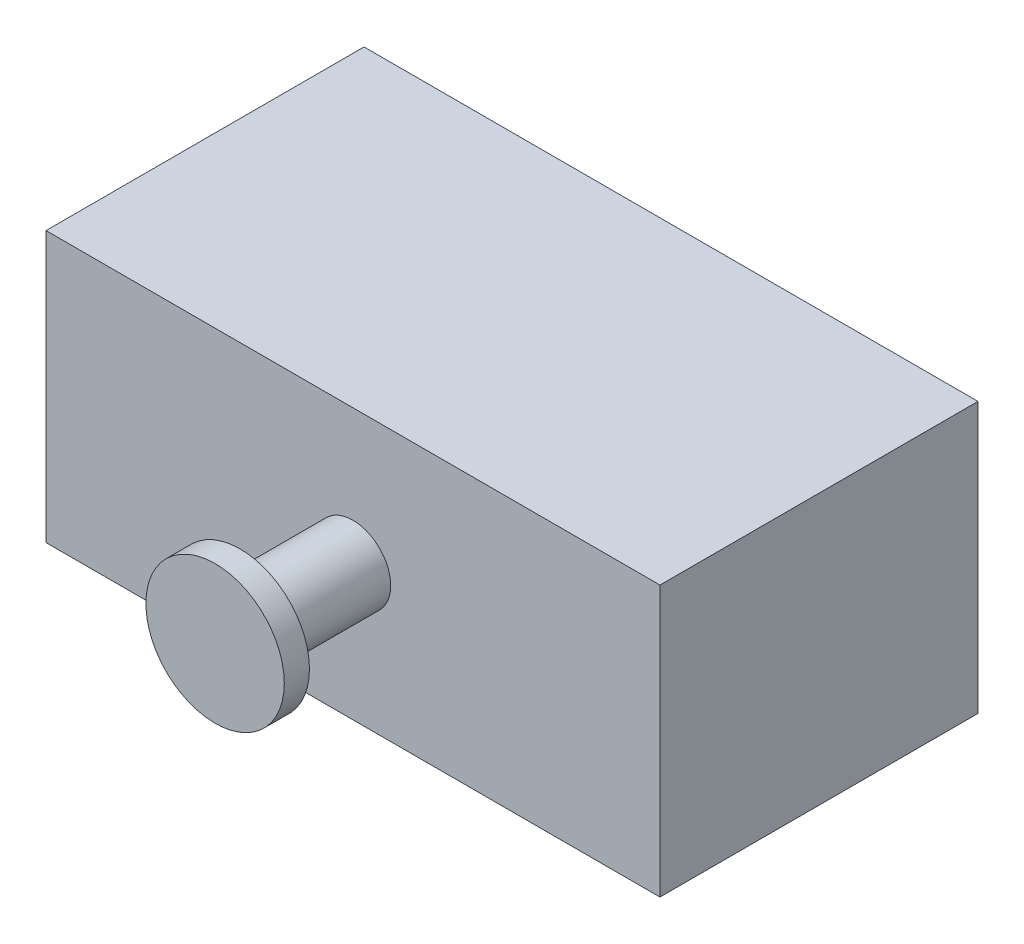
ISO-10303-21;
HEADER;
FILE_DESCRIPTION(('STEP AP214'),'2;1');
FILE_NAME('part.step','',(''),(''),'','','');
FILE_SCHEMA(('AUTOMOTIVE_DESIGN { 1 0 10303 214 1 1 1 1 }'));
ENDSEC;
DATA;
#1=APPLICATION_CONTEXT('core data for automotive mechanical design processes');
#2=APPLICATION_PROTOCOL_DEFINITION('international standard','automotive_design',2000,#1);
#3=PRODUCT_CONTEXT('',#1,'mechanical');
#4=PRODUCT('Part','Part','',(#3));
#5=PRODUCT_RELATED_PRODUCT_CATEGORY('part','',(#4));
#6=PRODUCT_DEFINITION_FORMATION('','',#4);
#7=PRODUCT_DEFINITION_CONTEXT('part definition',#1,'design');
#8=PRODUCT_DEFINITION('design','',#6,#7);
#9=PRODUCT_DEFINITION_SHAPE('','',#8);
#10=(LENGTH_UNIT() NAMED_UNIT(*) SI_UNIT(.MILLI.,.METRE.));
#11=(NAMED_UNIT(*) PLANE_ANGLE_UNIT() SI_UNIT($,.RADIAN.));
#12=(NAMED_UNIT(*) SI_UNIT($,.STERADIAN.) SOLID_ANGLE_UNIT());
#13=UNCERTAINTY_MEASURE_WITH_UNIT(LENGTH_MEASURE(1.E-05),#10,'distance_accuracy_value','');
#14=(GEOMETRIC_REPRESENTATION_CONTEXT(3) GLOBAL_UNCERTAINTY_ASSIGNED_CONTEXT((#13)) GLOBAL_UNIT_ASSIGNED_CONTEXT((#10,
#11,#12)) REPRESENTATION_CONTEXT('',''));
#15=CARTESIAN_POINT('',(0.,0.,0.));
#16=DIRECTION('',(0.,0.,1.));
#17=DIRECTION('',(1.,0.,0.));
#18=AXIS2_PLACEMENT_3D('',#15,#16,#17);
#19=CARTESIAN_POINT('',(-43.2996724615772,-115.618508944318,160.528));
#20=DIRECTION('',(0.,0.,1.));
#21=DIRECTION('',(1.,0.,0.));
#22=AXIS2_PLACEMENT_3D('',#19,#20,#21);
#23=PLANE('',#22);
#24=DIRECTION('',(0.,-1.,0.));
#25=VECTOR('',#24,1.);
#26=CARTESIAN_POINT('',(-43.2996724615772,20.7794910556815,160.528));
#27=LINE('',#26,#25);
#28=CARTESIAN_POINT('',(-43.2996724615772,20.7794910556815,160.528));
#29=VERTEX_POINT('',#28);
#30=CARTESIAN_POINT('',(-43.2996724615772,-115.618508944318,160.528));
#31=VERTEX_POINT('',#30);
#32=EDGE_CURVE('E84',#29,#31,#27,.T.);
#33=ORIENTED_EDGE('',*,*,#32,.T.);
#34=DIRECTION('',(1.,0.,0.));
#35=VECTOR('',#34,1.);
#36=CARTESIAN_POINT('',(-43.2996724615772,-115.618508944318,160.528));
#37=LINE('',#36,#35);
#38=CARTESIAN_POINT('',(266.580327538423,-115.618508944318,160.528));
#39=VERTEX_POINT('',#38);
#40=EDGE_CURVE('E79',#31,#39,#37,.T.);
#41=ORIENTED_EDGE('',*,*,#40,.T.);
#42=DIRECTION('',(0.,1.,0.));
#43=VECTOR('',#42,1.);
#44=CARTESIAN_POINT('',(266.580327538423,20.7794910556815,160.528));
#45=LINE('',#44,#43);
#46=CARTESIAN_POINT('',(266.580327538423,20.7794910556815,160.528));
#47=VERTEX_POINT('',#46);
#48=EDGE_CURVE('E82',#39,#47,#45,.T.);
#49=ORIENTED_EDGE('',*,*,#48,.T.);
#50=DIRECTION('',(-1.,0.,0.));
#51=VECTOR('',#50,1.);
#52=CARTESIAN_POINT('',(-43.2996724615772,20.7794910556815,160.528));
#53=LINE('',#52,#51);
#54=EDGE_CURVE('E49',#47,#29,#53,.T.);
#55=ORIENTED_EDGE('',*,*,#54,.T.);
#56=EDGE_LOOP('',(#33,#41,#49,#55));
#57=FACE_BOUND('',#56,.T.);
#58=CARTESIAN_POINT('',(111.640327538423,-47.4195089443185,160.528));
#59=DIRECTION('',(0.,0.,1.));
#60=DIRECTION('',(1.,0.,0.));
#61=AXIS2_PLACEMENT_3D('',#58,#59,#60);
#62=CIRCLE('',#61,19.05);
#63=CARTESIAN_POINT('',(130.690327538423,-47.4195089443185,160.528));
#64=VERTEX_POINT('',#63);
#65=EDGE_CURVE('E110',#64,#64,#62,.T.);
#66=ORIENTED_EDGE('',*,*,#65,.F.);
#67=EDGE_LOOP('',(#66));
#68=FACE_BOUND('',#67,.T.);
#69=ADVANCED_FACE('F32',(#57,#68),#23,.T.);
#70=CARTESIAN_POINT('',(-43.2996724615772,20.7794910556815,160.528));
#71=DIRECTION('',(1.,0.,0.));
#72=DIRECTION('',(0.,1.,0.));
#73=AXIS2_PLACEMENT_3D('',#70,#71,#72);
#74=PLANE('',#73);
#75=DIRECTION('',(0.,-1.,0.));
#76=VECTOR('',#75,1.);
#77=CARTESIAN_POINT('',(-43.2996724615772,20.7794910556815,0.));
#78=LINE('',#77,#76);
#79=CARTESIAN_POINT('',(-43.2996724615772,20.7794910556815,0.));
#80=VERTEX_POINT('',#79);
#81=CARTESIAN_POINT('',(-43.2996724615772,-115.618508944318,0.));
#82=VERTEX_POINT('',#81);
#83=EDGE_CURVE('E96',#80,#82,#78,.T.);
#84=ORIENTED_EDGE('',*,*,#83,.T.);
#85=DIRECTION('',(0.,0.,-1.));
#86=VECTOR('',#85,1.);
#87=CARTESIAN_POINT('',(-43.2996724615772,-115.618508944318,160.528));
#88=LINE('',#87,#86);
#89=EDGE_CURVE('E11',#31,#82,#88,.T.);
#90=ORIENTED_EDGE('',*,*,#89,.F.);
#91=ORIENTED_EDGE('',*,*,#32,.F.);
#92=DIRECTION('',(0.,0.,-1.));
#93=VECTOR('',#92,1.);
#94=CARTESIAN_POINT('',(-43.2996724615772,20.7794910556815,160.528));
#95=LINE('',#94,#93);
#96=EDGE_CURVE('E92',#29,#80,#95,.T.);
#97=ORIENTED_EDGE('',*,*,#96,.T.);
#98=EDGE_LOOP('',(#84,#90,#91,#97));
#99=FACE_BOUND('',#98,.T.);
#100=ADVANCED_FACE('F34',(#99),#74,.F.);
#101=CARTESIAN_POINT('',(-43.2996724615772,-115.618508944318,160.528));
#102=DIRECTION('',(0.,1.,0.));
#103=DIRECTION('',(0.,0.,1.));
#104=AXIS2_PLACEMENT_3D('',#101,#102,#103);
#105=PLANE('',#104);
#106=DIRECTION('',(1.,0.,0.));
#107=VECTOR('',#106,1.);
#108=CARTESIAN_POINT('',(-43.2996724615772,-115.618508944318,0.));
#109=LINE('',#108,#107);
#110=CARTESIAN_POINT('',(266.580327538423,-115.618508944318,0.));
#111=VERTEX_POINT('',#110);
#112=EDGE_CURVE('E88',#82,#111,#109,.T.);
#113=ORIENTED_EDGE('',*,*,#112,.T.);
#114=DIRECTION('',(0.,0.,-1.));
#115=VECTOR('',#114,1.);
#116=CARTESIAN_POINT('',(266.580327538423,-115.618508944318,160.528));
#117=LINE('',#116,#115);
#118=EDGE_CURVE('E41',#39,#111,#117,.T.);
#119=ORIENTED_EDGE('',*,*,#118,.F.);
#120=ORIENTED_EDGE('',*,*,#40,.F.);
#121=ORIENTED_EDGE('',*,*,#89,.T.);
#122=EDGE_LOOP('',(#113,#119,#120,#121));
#123=FACE_BOUND('',#122,.T.);
#124=ADVANCED_FACE('F87',(#123),#105,.F.);
#125=CARTESIAN_POINT('',(266.580327538423,20.7794910556815,160.528));
#126=DIRECTION('',(-1.,0.,0.));
#127=DIRECTION('',(0.,0.,1.));
#128=AXIS2_PLACEMENT_3D('',#125,#126,#127);
#129=PLANE('',#128);
#130=DIRECTION('',(0.,1.,0.));
#131=VECTOR('',#130,1.);
#132=CARTESIAN_POINT('',(266.580327538423,20.7794910556815,0.));
#133=LINE('',#132,#131);
#134=CARTESIAN_POINT('',(266.580327538423,20.7794910556815,0.));
#135=VERTEX_POINT('',#134);
#136=EDGE_CURVE('E66',#111,#135,#133,.T.);
#137=ORIENTED_EDGE('',*,*,#136,.T.);
#138=DIRECTION('',(0.,0.,-1.));
#139=VECTOR('',#138,1.);
#140=CARTESIAN_POINT('',(266.580327538423,20.7794910556815,160.528));
#141=LINE('',#140,#139);
#142=EDGE_CURVE('E89',#47,#135,#141,.T.);
#143=ORIENTED_EDGE('',*,*,#142,.F.);
#144=ORIENTED_EDGE('',*,*,#48,.F.);
#145=ORIENTED_EDGE('',*,*,#118,.T.);
#146=EDGE_LOOP('',(#137,#143,#144,#145));
#147=FACE_BOUND('',#146,.T.);
#148=ADVANCED_FACE('F90',(#147),#129,.F.);
#149=CARTESIAN_POINT('',(-43.2996724615772,20.7794910556815,160.528));
#150=DIRECTION('',(0.,-1.,0.));
#151=DIRECTION('',(0.,0.,-1.));
#152=AXIS2_PLACEMENT_3D('',#149,#150,#151);
#153=PLANE('',#152);
#154=DIRECTION('',(-1.,0.,0.));
#155=VECTOR('',#154,1.);
#156=CARTESIAN_POINT('',(-43.2996724615772,20.7794910556815,0.));
#157=LINE('',#156,#155);
#158=EDGE_CURVE('E72',#135,#80,#157,.T.);
#159=ORIENTED_EDGE('',*,*,#158,.T.);
#160=ORIENTED_EDGE('',*,*,#96,.F.);
#161=ORIENTED_EDGE('',*,*,#54,.F.);
#162=ORIENTED_EDGE('',*,*,#142,.T.);
#163=EDGE_LOOP('',(#159,#160,#161,#162));
#164=FACE_BOUND('',#163,.T.);
#165=ADVANCED_FACE('F104',(#164),#153,.F.);
#166=CARTESIAN_POINT('',(-43.2996724615772,-115.618508944318,0.));
#167=DIRECTION('',(0.,0.,1.));
#168=DIRECTION('',(1.,0.,0.));
#169=AXIS2_PLACEMENT_3D('',#166,#167,#168);
#170=PLANE('',#169);
#171=ORIENTED_EDGE('',*,*,#83,.F.);
#172=ORIENTED_EDGE('',*,*,#158,.F.);
#173=ORIENTED_EDGE('',*,*,#136,.F.);
#174=ORIENTED_EDGE('',*,*,#112,.F.);
#175=EDGE_LOOP('',(#171,#172,#173,#174));
#176=FACE_BOUND('',#175,.T.);
#177=ADVANCED_FACE('F107',(#176),#170,.F.);
#178=CARTESIAN_POINT('',(111.640327538423,-47.4195089443185,217.424));
#179=DIRECTION('',(0.,0.,-1.));
#180=DIRECTION('',(-1.,0.,0.));
#181=AXIS2_PLACEMENT_3D('',#178,#179,#180);
#182=CYLINDRICAL_SURFACE('',#181,19.05);
#183=CARTESIAN_POINT('',(111.640327538423,-47.4195089443185,217.424));
#184=DIRECTION('',(0.,0.,1.));
#185=DIRECTION('',(1.,0.,0.));
#186=AXIS2_PLACEMENT_3D('',#183,#184,#185);
#187=CIRCLE('',#186,19.05);
#188=CARTESIAN_POINT('',(130.690327538423,-47.4195089443185,217.424));
#189=VERTEX_POINT('',#188);
#190=EDGE_CURVE('E99',#189,#189,#187,.T.);
#191=ORIENTED_EDGE('',*,*,#190,.F.);
#192=EDGE_LOOP('',(#191));
#193=FACE_BOUND('',#192,.T.);
#194=ORIENTED_EDGE('',*,*,#65,.T.);
#195=EDGE_LOOP('',(#194));
#196=FACE_BOUND('',#195,.T.);
#197=ADVANCED_FACE('F133',(#193,#196),#182,.T.);
#198=CARTESIAN_POINT('',(111.640327538423,-47.4195089443185,217.424));
#199=DIRECTION('',(0.,0.,1.));
#200=DIRECTION('',(1.,0.,0.));
#201=AXIS2_PLACEMENT_3D('',#198,#199,#200);
#202=PLANE('',#201);
#203=CARTESIAN_POINT('',(111.640327538423,-47.4195089443185,217.424));
#204=DIRECTION('',(0.,0.,1.));
#205=DIRECTION('',(1.,0.,0.));
#206=AXIS2_PLACEMENT_3D('',#203,#204,#205);
#207=CIRCLE('',#206,34.925);
#208=CARTESIAN_POINT('',(146.565327538423,-47.4195089443185,217.424));
#209=VERTEX_POINT('',#208);
#210=EDGE_CURVE('E116',#209,#209,#207,.T.);
#211=ORIENTED_EDGE('',*,*,#210,.F.);
#212=EDGE_LOOP('',(#211));
#213=FACE_BOUND('',#212,.T.);
#214=ORIENTED_EDGE('',*,*,#190,.T.);
#215=EDGE_LOOP('',(#214));
#216=FACE_BOUND('',#215,.T.);
#217=ADVANCED_FACE('F127',(#213,#216),#202,.F.);
#218=CARTESIAN_POINT('',(111.640327538423,-47.4195089443185,230.124));
#219=DIRECTION('',(0.,0.,-1.));
#220=DIRECTION('',(-1.,0.,0.));
#221=AXIS2_PLACEMENT_3D('',#218,#219,#220);
#222=CYLINDRICAL_SURFACE('',#221,34.925);
#223=CARTESIAN_POINT('',(111.640327538423,-47.4195089443185,230.124));
#224=DIRECTION('',(0.,0.,1.));
#225=DIRECTION('',(1.,0.,0.));
#226=AXIS2_PLACEMENT_3D('',#223,#224,#225);
#227=CIRCLE('',#226,34.925);
#228=CARTESIAN_POINT('',(146.565327538423,-47.4195089443185,230.124));
#229=VERTEX_POINT('',#228);
#230=EDGE_CURVE('E113',#229,#229,#227,.T.);
#231=ORIENTED_EDGE('',*,*,#230,.F.);
#232=EDGE_LOOP('',(#231));
#233=FACE_BOUND('',#232,.T.);
#234=ORIENTED_EDGE('',*,*,#210,.T.);
#235=EDGE_LOOP('',(#234));
#236=FACE_BOUND('',#235,.T.);
#237=ADVANCED_FACE('F124',(#233,#236),#222,.T.);
#238=CARTESIAN_POINT('',(111.640327538423,-47.4195089443185,230.124));
#239=DIRECTION('',(0.,0.,1.));
#240=DIRECTION('',(1.,0.,0.));
#241=AXIS2_PLACEMENT_3D('',#238,#239,#240);
#242=PLANE('',#241);
#243=ORIENTED_EDGE('',*,*,#230,.T.);
#244=EDGE_LOOP('',(#243));
#245=FACE_BOUND('',#244,.T.);
#246=ADVANCED_FACE('F122',(#245),#242,.T.);
#247=CLOSED_SHELL('',(#69,#100,#124,#148,#165,#177,#197,#217,#237,#246));
#248=MANIFOLD_SOLID_BREP('B2',#247);
#249=ADVANCED_BREP_SHAPE_REPRESENTATION('',(#18,#248),#14);
#250=SHAPE_DEFINITION_REPRESENTATION(#9,#249);
ENDSEC;
END-ISO-10303-21;
